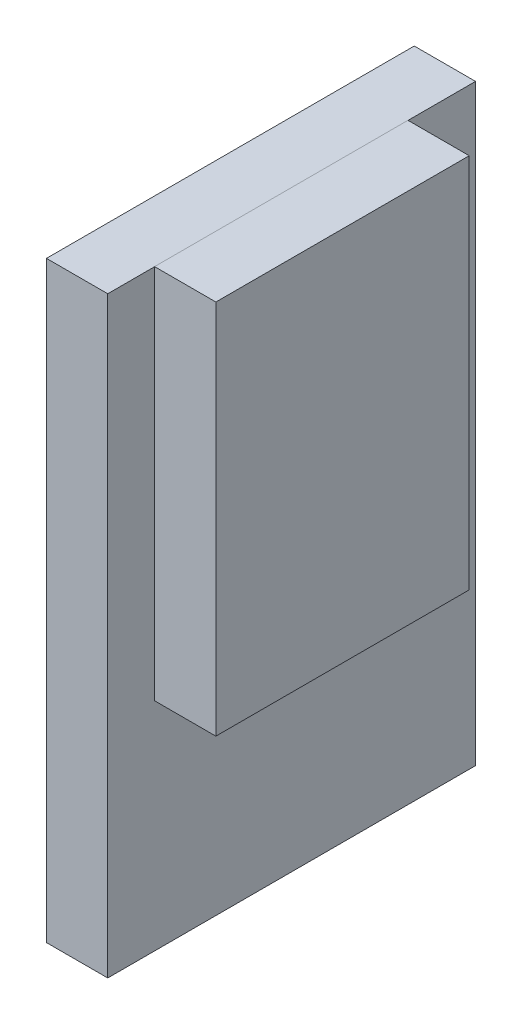
ISO-10303-21;
HEADER;
FILE_DESCRIPTION(('STEP AP214'),'2;1');
FILE_NAME('part.step','',(''),(''),'','','');
FILE_SCHEMA(('AUTOMOTIVE_DESIGN { 1 0 10303 214 1 1 1 1 }'));
ENDSEC;
DATA;
#1=APPLICATION_CONTEXT('core data for automotive mechanical design processes');
#2=APPLICATION_PROTOCOL_DEFINITION('international standard','automotive_design',2000,#1);
#3=PRODUCT_CONTEXT('',#1,'mechanical');
#4=PRODUCT('Part','Part','',(#3));
#5=PRODUCT_RELATED_PRODUCT_CATEGORY('part','',(#4));
#6=PRODUCT_DEFINITION_FORMATION('','',#4);
#7=PRODUCT_DEFINITION_CONTEXT('part definition',#1,'design');
#8=PRODUCT_DEFINITION('design','',#6,#7);
#9=PRODUCT_DEFINITION_SHAPE('','',#8);
#10=(LENGTH_UNIT() NAMED_UNIT(*) SI_UNIT(.MILLI.,.METRE.));
#11=(NAMED_UNIT(*) PLANE_ANGLE_UNIT() SI_UNIT($,.RADIAN.));
#12=(NAMED_UNIT(*) SI_UNIT($,.STERADIAN.) SOLID_ANGLE_UNIT());
#13=UNCERTAINTY_MEASURE_WITH_UNIT(LENGTH_MEASURE(1.E-05),#10,'distance_accuracy_value','');
#14=(GEOMETRIC_REPRESENTATION_CONTEXT(3) GLOBAL_UNCERTAINTY_ASSIGNED_CONTEXT((#13)) GLOBAL_UNIT_ASSIGNED_CONTEXT((#10,
#11,#12)) REPRESENTATION_CONTEXT('',''));
#15=CARTESIAN_POINT('',(0.,0.,0.));
#16=DIRECTION('',(0.,0.,1.));
#17=DIRECTION('',(1.,0.,0.));
#18=AXIS2_PLACEMENT_3D('',#15,#16,#17);
#19=CARTESIAN_POINT('',(0.,-58.42,39.37));
#20=DIRECTION('',(1.,0.,0.));
#21=DIRECTION('',(0.,0.,-1.));
#22=AXIS2_PLACEMENT_3D('',#19,#20,#21);
#23=PLANE('',#22);
#24=DIRECTION('',(0.,0.,-1.));
#25=VECTOR('',#24,1.);
#26=CARTESIAN_POINT('',(0.,58.3903953754457,53.9187372050963));
#27=LINE('',#26,#25);
#28=CARTESIAN_POINT('',(0.,58.3903953754457,39.37));
#29=VERTEX_POINT('',#28);
#30=CARTESIAN_POINT('',(0.,58.3903953754457,-39.37));
#31=VERTEX_POINT('',#30);
#32=EDGE_CURVE('E11',#29,#31,#27,.T.);
#33=ORIENTED_EDGE('',*,*,#32,.F.);
#34=DIRECTION('',(0.,-1.,0.));
#35=VECTOR('',#34,1.);
#36=CARTESIAN_POINT('',(0.,58.42,39.37));
#37=LINE('',#36,#35);
#38=CARTESIAN_POINT('',(0.,58.42,39.37));
#39=VERTEX_POINT('',#38);
#40=EDGE_CURVE('E147',#39,#29,#37,.T.);
#41=ORIENTED_EDGE('',*,*,#40,.F.);
#42=DIRECTION('',(0.,0.,1.));
#43=VECTOR('',#42,1.);
#44=CARTESIAN_POINT('',(0.,58.42,39.37));
#45=LINE('',#44,#43);
#46=CARTESIAN_POINT('',(0.,58.42,-39.37));
#47=VERTEX_POINT('',#46);
#48=EDGE_CURVE('E81',#47,#39,#45,.T.);
#49=ORIENTED_EDGE('',*,*,#48,.F.);
#50=DIRECTION('',(0.,1.,0.));
#51=VECTOR('',#50,1.);
#52=CARTESIAN_POINT('',(0.,58.42,-39.37));
#53=LINE('',#52,#51);
#54=EDGE_CURVE('E162',#31,#47,#53,.T.);
#55=ORIENTED_EDGE('',*,*,#54,.F.);
#56=EDGE_LOOP('',(#33,#41,#49,#55));
#57=FACE_BOUND('',#56,.T.);
#58=ADVANCED_FACE('F35',(#57),#23,.F.);
#59=CARTESIAN_POINT('',(19.05,58.42,39.37));
#60=DIRECTION('',(0.,0.,-1.));
#61=DIRECTION('',(0.,1.,0.));
#62=AXIS2_PLACEMENT_3D('',#59,#60,#61);
#63=PLANE('',#62);
#64=ORIENTED_EDGE('',*,*,#40,.T.);
#65=CARTESIAN_POINT('',(0.,-58.42,39.37));
#66=VERTEX_POINT('',#65);
#67=EDGE_CURVE('E145',#29,#66,#37,.T.);
#68=ORIENTED_EDGE('',*,*,#67,.T.);
#69=DIRECTION('',(-1.,0.,0.));
#70=VECTOR('',#69,1.);
#71=CARTESIAN_POINT('',(19.05,-58.42,39.37));
#72=LINE('',#71,#70);
#73=CARTESIAN_POINT('',(19.05,-58.42,39.37));
#74=VERTEX_POINT('',#73);
#75=EDGE_CURVE('E39',#74,#66,#72,.T.);
#76=ORIENTED_EDGE('',*,*,#75,.F.);
#77=DIRECTION('',(0.,-1.,0.));
#78=VECTOR('',#77,1.);
#79=CARTESIAN_POINT('',(19.05,58.42,39.37));
#80=LINE('',#79,#78);
#81=CARTESIAN_POINT('',(19.05,58.42,39.37));
#82=VERTEX_POINT('',#81);
#83=EDGE_CURVE('E153',#82,#74,#80,.T.);
#84=ORIENTED_EDGE('',*,*,#83,.F.);
#85=DIRECTION('',(-1.,0.,0.));
#86=VECTOR('',#85,1.);
#87=CARTESIAN_POINT('',(19.05,58.42,39.37));
#88=LINE('',#87,#86);
#89=EDGE_CURVE('E158',#82,#39,#88,.T.);
#90=ORIENTED_EDGE('',*,*,#89,.T.);
#91=EDGE_LOOP('',(#64,#68,#76,#84,#90));
#92=FACE_BOUND('',#91,.T.);
#93=ADVANCED_FACE('F37',(#92),#63,.F.);
#94=CARTESIAN_POINT('',(19.05,-58.42,39.37));
#95=DIRECTION('',(0.,1.,0.));
#96=DIRECTION('',(0.,0.,1.));
#97=AXIS2_PLACEMENT_3D('',#94,#95,#96);
#98=PLANE('',#97);
#99=DIRECTION('',(0.,0.,-1.));
#100=VECTOR('',#99,1.);
#101=CARTESIAN_POINT('',(0.,-58.42,39.37));
#102=LINE('',#101,#100);
#103=CARTESIAN_POINT('',(0.,-58.42,-39.37));
#104=VERTEX_POINT('',#103);
#105=EDGE_CURVE('E160',#66,#104,#102,.T.);
#106=ORIENTED_EDGE('',*,*,#105,.T.);
#107=DIRECTION('',(-1.,0.,0.));
#108=VECTOR('',#107,1.);
#109=CARTESIAN_POINT('',(19.05,-58.42,-39.37));
#110=LINE('',#109,#108);
#111=CARTESIAN_POINT('',(19.05,-58.42,-39.37));
#112=VERTEX_POINT('',#111);
#113=EDGE_CURVE('E168',#112,#104,#110,.T.);
#114=ORIENTED_EDGE('',*,*,#113,.F.);
#115=DIRECTION('',(0.,0.,-1.));
#116=VECTOR('',#115,1.);
#117=CARTESIAN_POINT('',(19.05,-58.42,39.37));
#118=LINE('',#117,#116);
#119=EDGE_CURVE('E89',#74,#112,#118,.T.);
#120=ORIENTED_EDGE('',*,*,#119,.F.);
#121=ORIENTED_EDGE('',*,*,#75,.T.);
#122=EDGE_LOOP('',(#106,#114,#120,#121));
#123=FACE_BOUND('',#122,.T.);
#124=ADVANCED_FACE('F175',(#123),#98,.F.);
#125=CARTESIAN_POINT('',(19.05,58.42,-39.37));
#126=DIRECTION('',(0.,0.,1.));
#127=DIRECTION('',(0.,-1.,0.));
#128=AXIS2_PLACEMENT_3D('',#125,#126,#127);
#129=PLANE('',#128);
#130=EDGE_CURVE('E163',#104,#31,#53,.T.);
#131=ORIENTED_EDGE('',*,*,#130,.T.);
#132=ORIENTED_EDGE('',*,*,#54,.T.);
#133=DIRECTION('',(-1.,0.,0.));
#134=VECTOR('',#133,1.);
#135=CARTESIAN_POINT('',(19.05,58.42,-39.37));
#136=LINE('',#135,#134);
#137=CARTESIAN_POINT('',(19.05,58.42,-39.37));
#138=VERTEX_POINT('',#137);
#139=EDGE_CURVE('E167',#138,#47,#136,.T.);
#140=ORIENTED_EDGE('',*,*,#139,.F.);
#141=DIRECTION('',(0.,1.,0.));
#142=VECTOR('',#141,1.);
#143=CARTESIAN_POINT('',(19.05,58.42,-39.37));
#144=LINE('',#143,#142);
#145=EDGE_CURVE('E156',#112,#138,#144,.T.);
#146=ORIENTED_EDGE('',*,*,#145,.F.);
#147=ORIENTED_EDGE('',*,*,#113,.T.);
#148=EDGE_LOOP('',(#131,#132,#140,#146,#147));
#149=FACE_BOUND('',#148,.T.);
#150=ADVANCED_FACE('F183',(#149),#129,.F.);
#151=CARTESIAN_POINT('',(19.05,58.42,39.37));
#152=DIRECTION('',(0.,-1.,0.));
#153=DIRECTION('',(0.,0.,-1.));
#154=AXIS2_PLACEMENT_3D('',#151,#152,#153);
#155=PLANE('',#154);
#156=ORIENTED_EDGE('',*,*,#48,.T.);
#157=ORIENTED_EDGE('',*,*,#89,.F.);
#158=DIRECTION('',(0.,0.,1.));
#159=VECTOR('',#158,1.);
#160=CARTESIAN_POINT('',(19.05,58.42,39.37));
#161=LINE('',#160,#159);
#162=EDGE_CURVE('E60',#138,#82,#161,.T.);
#163=ORIENTED_EDGE('',*,*,#162,.F.);
#164=ORIENTED_EDGE('',*,*,#139,.T.);
#165=EDGE_LOOP('',(#156,#157,#163,#164));
#166=FACE_BOUND('',#165,.T.);
#167=ADVANCED_FACE('F185',(#166),#155,.F.);
#168=CARTESIAN_POINT('',(19.05,-58.42,39.37));
#169=DIRECTION('',(1.,0.,0.));
#170=DIRECTION('',(0.,0.,-1.));
#171=AXIS2_PLACEMENT_3D('',#168,#169,#170);
#172=PLANE('',#171);
#173=ORIENTED_EDGE('',*,*,#83,.T.);
#174=ORIENTED_EDGE('',*,*,#119,.T.);
#175=ORIENTED_EDGE('',*,*,#145,.T.);
#176=ORIENTED_EDGE('',*,*,#162,.T.);
#177=EDGE_LOOP('',(#173,#174,#175,#176));
#178=FACE_BOUND('',#177,.T.);
#179=ADVANCED_FACE('F186',(#178),#172,.T.);
#180=CARTESIAN_POINT('',(-19.05,-125.759604624554,53.9187372050963));
#181=DIRECTION('',(0.,0.,-1.));
#182=DIRECTION('',(-1.,0.,0.));
#183=AXIS2_PLACEMENT_3D('',#180,#181,#182);
#184=PLANE('',#183);
#185=DIRECTION('',(0.,1.,0.));
#186=VECTOR('',#185,1.);
#187=CARTESIAN_POINT('',(0.,-125.759604624554,53.9187372050963));
#188=LINE('',#187,#186);
#189=CARTESIAN_POINT('',(0.,-125.759604624554,53.9187372050963));
#190=VERTEX_POINT('',#189);
#191=CARTESIAN_POINT('',(0.,58.3903953754457,53.9187372050963));
#192=VERTEX_POINT('',#191);
#193=EDGE_CURVE('E144',#190,#192,#188,.T.);
#194=ORIENTED_EDGE('',*,*,#193,.T.);
#195=DIRECTION('',(1.,0.,0.));
#196=VECTOR('',#195,1.);
#197=CARTESIAN_POINT('',(-19.05,58.3903953754457,53.9187372050963));
#198=LINE('',#197,#196);
#199=CARTESIAN_POINT('',(-19.05,58.3903953754457,53.9187372050963));
#200=VERTEX_POINT('',#199);
#201=EDGE_CURVE('E124',#200,#192,#198,.T.);
#202=ORIENTED_EDGE('',*,*,#201,.F.);
#203=DIRECTION('',(0.,1.,0.));
#204=VECTOR('',#203,1.);
#205=CARTESIAN_POINT('',(-19.05,-125.759604624554,53.9187372050963));
#206=LINE('',#205,#204);
#207=CARTESIAN_POINT('',(-19.05,-125.759604624554,53.9187372050963));
#208=VERTEX_POINT('',#207);
#209=EDGE_CURVE('E131',#208,#200,#206,.T.);
#210=ORIENTED_EDGE('',*,*,#209,.F.);
#211=DIRECTION('',(1.,0.,0.));
#212=VECTOR('',#211,1.);
#213=CARTESIAN_POINT('',(-19.05,-125.759604624554,53.9187372050963));
#214=LINE('',#213,#212);
#215=EDGE_CURVE('E266',#208,#190,#214,.T.);
#216=ORIENTED_EDGE('',*,*,#215,.T.);
#217=EDGE_LOOP('',(#194,#202,#210,#216));
#218=FACE_BOUND('',#217,.T.);
#219=ADVANCED_FACE('F142',(#218),#184,.F.);
#220=CARTESIAN_POINT('',(-19.05,58.3903953754457,53.9187372050963));
#221=DIRECTION('',(0.,-1.,0.));
#222=DIRECTION('',(0.,0.,-1.));
#223=AXIS2_PLACEMENT_3D('',#220,#221,#222);
#224=PLANE('',#223);
#225=EDGE_CURVE('E45',#192,#29,#27,.T.);
#226=ORIENTED_EDGE('',*,*,#225,.T.);
#227=ORIENTED_EDGE('',*,*,#32,.T.);
#228=CARTESIAN_POINT('',(0.,58.3903953754457,-60.3812627949037));
#229=VERTEX_POINT('',#228);
#230=EDGE_CURVE('E46',#31,#229,#27,.T.);
#231=ORIENTED_EDGE('',*,*,#230,.T.);
#232=DIRECTION('',(1.,0.,0.));
#233=VECTOR('',#232,1.);
#234=CARTESIAN_POINT('',(-19.05,58.3903953754457,-60.3812627949037));
#235=LINE('',#234,#233);
#236=CARTESIAN_POINT('',(-19.05,58.3903953754457,-60.3812627949037));
#237=VERTEX_POINT('',#236);
#238=EDGE_CURVE('E127',#237,#229,#235,.T.);
#239=ORIENTED_EDGE('',*,*,#238,.F.);
#240=DIRECTION('',(0.,0.,-1.));
#241=VECTOR('',#240,1.);
#242=CARTESIAN_POINT('',(-19.05,58.3903953754457,53.9187372050963));
#243=LINE('',#242,#241);
#244=EDGE_CURVE('E119',#200,#237,#243,.T.);
#245=ORIENTED_EDGE('',*,*,#244,.F.);
#246=ORIENTED_EDGE('',*,*,#201,.T.);
#247=EDGE_LOOP('',(#226,#227,#231,#239,#245,#246));
#248=FACE_BOUND('',#247,.T.);
#249=ADVANCED_FACE('F122',(#248),#224,.F.);
#250=CARTESIAN_POINT('',(-19.05,-125.759604624554,-60.3812627949037));
#251=DIRECTION('',(0.,0.,1.));
#252=DIRECTION('',(1.,0.,0.));
#253=AXIS2_PLACEMENT_3D('',#250,#251,#252);
#254=PLANE('',#253);
#255=DIRECTION('',(0.,-1.,0.));
#256=VECTOR('',#255,1.);
#257=CARTESIAN_POINT('',(0.,-125.759604624554,-60.3812627949037));
#258=LINE('',#257,#256);
#259=CARTESIAN_POINT('',(0.,-125.759604624554,-60.3812627949037));
#260=VERTEX_POINT('',#259);
#261=EDGE_CURVE('E268',#229,#260,#258,.T.);
#262=ORIENTED_EDGE('',*,*,#261,.T.);
#263=DIRECTION('',(1.,0.,0.));
#264=VECTOR('',#263,1.);
#265=CARTESIAN_POINT('',(-19.05,-125.759604624554,-60.3812627949037));
#266=LINE('',#265,#264);
#267=CARTESIAN_POINT('',(-19.05,-125.759604624554,-60.3812627949037));
#268=VERTEX_POINT('',#267);
#269=EDGE_CURVE('E149',#268,#260,#266,.T.);
#270=ORIENTED_EDGE('',*,*,#269,.F.);
#271=DIRECTION('',(0.,-1.,0.));
#272=VECTOR('',#271,1.);
#273=CARTESIAN_POINT('',(-19.05,-125.759604624554,-60.3812627949037));
#274=LINE('',#273,#272);
#275=EDGE_CURVE('E130',#237,#268,#274,.T.);
#276=ORIENTED_EDGE('',*,*,#275,.F.);
#277=ORIENTED_EDGE('',*,*,#238,.T.);
#278=EDGE_LOOP('',(#262,#270,#276,#277));
#279=FACE_BOUND('',#278,.T.);
#280=ADVANCED_FACE('F225',(#279),#254,.F.);
#281=CARTESIAN_POINT('',(-19.05,-125.759604624554,53.9187372050963));
#282=DIRECTION('',(0.,1.,0.));
#283=DIRECTION('',(0.,0.,1.));
#284=AXIS2_PLACEMENT_3D('',#281,#282,#283);
#285=PLANE('',#284);
#286=DIRECTION('',(0.,0.,1.));
#287=VECTOR('',#286,1.);
#288=CARTESIAN_POINT('',(0.,-125.759604624554,53.9187372050963));
#289=LINE('',#288,#287);
#290=EDGE_CURVE('E140',#260,#190,#289,.T.);
#291=ORIENTED_EDGE('',*,*,#290,.T.);
#292=ORIENTED_EDGE('',*,*,#215,.F.);
#293=DIRECTION('',(0.,0.,1.));
#294=VECTOR('',#293,1.);
#295=CARTESIAN_POINT('',(-19.05,-125.759604624554,53.9187372050963));
#296=LINE('',#295,#294);
#297=EDGE_CURVE('E136',#268,#208,#296,.T.);
#298=ORIENTED_EDGE('',*,*,#297,.F.);
#299=ORIENTED_EDGE('',*,*,#269,.T.);
#300=EDGE_LOOP('',(#291,#292,#298,#299));
#301=FACE_BOUND('',#300,.T.);
#302=ADVANCED_FACE('F234',(#301),#285,.F.);
#303=CARTESIAN_POINT('',(-19.05,0.,0.));
#304=DIRECTION('',(-1.,0.,0.));
#305=DIRECTION('',(0.,0.,1.));
#306=AXIS2_PLACEMENT_3D('',#303,#304,#305);
#307=PLANE('',#306);
#308=ORIENTED_EDGE('',*,*,#209,.T.);
#309=ORIENTED_EDGE('',*,*,#244,.T.);
#310=ORIENTED_EDGE('',*,*,#275,.T.);
#311=ORIENTED_EDGE('',*,*,#297,.T.);
#312=EDGE_LOOP('',(#308,#309,#310,#311));
#313=FACE_BOUND('',#312,.T.);
#314=ADVANCED_FACE('F134',(#313),#307,.T.);
#315=CARTESIAN_POINT('',(0.,0.,0.));
#316=DIRECTION('',(-1.,0.,0.));
#317=DIRECTION('',(0.,0.,1.));
#318=AXIS2_PLACEMENT_3D('',#315,#316,#317);
#319=PLANE('',#318);
#320=ORIENTED_EDGE('',*,*,#67,.F.);
#321=ORIENTED_EDGE('',*,*,#225,.F.);
#322=ORIENTED_EDGE('',*,*,#193,.F.);
#323=ORIENTED_EDGE('',*,*,#290,.F.);
#324=ORIENTED_EDGE('',*,*,#261,.F.);
#325=ORIENTED_EDGE('',*,*,#230,.F.);
#326=ORIENTED_EDGE('',*,*,#130,.F.);
#327=ORIENTED_EDGE('',*,*,#105,.F.);
#328=EDGE_LOOP('',(#320,#321,#322,#323,#324,#325,#326,#327));
#329=FACE_BOUND('',#328,.T.);
#330=ADVANCED_FACE('F180',(#329),#319,.F.);
#331=CLOSED_SHELL('',(#58,#93,#124,#150,#167,#179,#219,#249,#280,#302,#314,#330));
#332=MANIFOLD_SOLID_BREP('B2',#331);
#333=ADVANCED_BREP_SHAPE_REPRESENTATION('',(#18,#332),#14);
#334=SHAPE_DEFINITION_REPRESENTATION(#9,#333);
ENDSEC;
END-ISO-10303-21;
